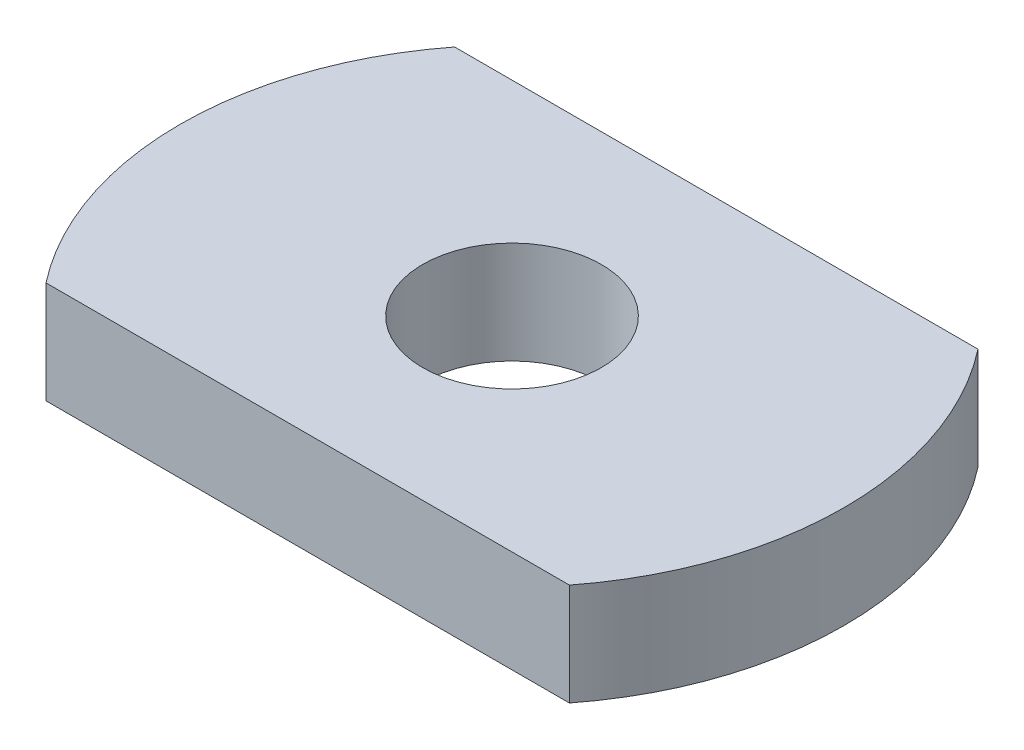
ISO-10303-21;
HEADER;
FILE_DESCRIPTION(('STEP AP214'),'2;1');
FILE_NAME('part.step','',(''),(''),'','','');
FILE_SCHEMA(('AUTOMOTIVE_DESIGN { 1 0 10303 214 1 1 1 1 }'));
ENDSEC;
DATA;
#1=APPLICATION_CONTEXT('core data for automotive mechanical design processes');
#2=APPLICATION_PROTOCOL_DEFINITION('international standard','automotive_design',2000,#1);
#3=PRODUCT_CONTEXT('',#1,'mechanical');
#4=PRODUCT('Part','Part','',(#3));
#5=PRODUCT_RELATED_PRODUCT_CATEGORY('part','',(#4));
#6=PRODUCT_DEFINITION_FORMATION('','',#4);
#7=PRODUCT_DEFINITION_CONTEXT('part definition',#1,'design');
#8=PRODUCT_DEFINITION('design','',#6,#7);
#9=PRODUCT_DEFINITION_SHAPE('','',#8);
#10=(LENGTH_UNIT() NAMED_UNIT(*) SI_UNIT(.MILLI.,.METRE.));
#11=(NAMED_UNIT(*) PLANE_ANGLE_UNIT() SI_UNIT($,.RADIAN.));
#12=(NAMED_UNIT(*) SI_UNIT($,.STERADIAN.) SOLID_ANGLE_UNIT());
#13=UNCERTAINTY_MEASURE_WITH_UNIT(LENGTH_MEASURE(1.E-05),#10,'distance_accuracy_value','');
#14=(GEOMETRIC_REPRESENTATION_CONTEXT(3) GLOBAL_UNCERTAINTY_ASSIGNED_CONTEXT((#13)) GLOBAL_UNIT_ASSIGNED_CONTEXT((#10,
#11,#12)) REPRESENTATION_CONTEXT('',''));
#15=CARTESIAN_POINT('',(0.,0.,0.));
#16=DIRECTION('',(0.,0.,1.));
#17=DIRECTION('',(1.,0.,0.));
#18=AXIS2_PLACEMENT_3D('',#15,#16,#17);
#19=CARTESIAN_POINT('',(0.,2.,4.));
#20=DIRECTION('',(0.,0.,-1.));
#21=DIRECTION('',(-1.,0.,0.));
#22=AXIS2_PLACEMENT_3D('',#19,#20,#21);
#23=PLANE('',#22);
#24=DIRECTION('',(1.,0.,0.));
#25=VECTOR('',#24,1.);
#26=CARTESIAN_POINT('',(0.,0.,4.));
#27=LINE('',#26,#25);
#28=CARTESIAN_POINT('',(-5.1234753829798,0.,4.));
#29=VERTEX_POINT('',#28);
#30=CARTESIAN_POINT('',(5.1234753829798,0.,4.));
#31=VERTEX_POINT('',#30);
#32=EDGE_CURVE('E119',#29,#31,#27,.T.);
#33=ORIENTED_EDGE('',*,*,#32,.T.);
#34=DIRECTION('',(0.,-1.,0.));
#35=VECTOR('',#34,1.);
#36=CARTESIAN_POINT('',(5.1234753829798,2.,4.));
#37=LINE('',#36,#35);
#38=CARTESIAN_POINT('',(5.1234753829798,2.,4.));
#39=VERTEX_POINT('',#38);
#40=EDGE_CURVE('E11',#39,#31,#37,.T.);
#41=ORIENTED_EDGE('',*,*,#40,.F.);
#42=DIRECTION('',(1.,0.,0.));
#43=VECTOR('',#42,1.);
#44=CARTESIAN_POINT('',(0.,2.,4.));
#45=LINE('',#44,#43);
#46=CARTESIAN_POINT('',(-5.1234753829798,2.,4.));
#47=VERTEX_POINT('',#46);
#48=EDGE_CURVE('E96',#47,#39,#45,.T.);
#49=ORIENTED_EDGE('',*,*,#48,.F.);
#50=DIRECTION('',(0.,-1.,0.));
#51=VECTOR('',#50,1.);
#52=CARTESIAN_POINT('',(-5.1234753829798,2.,4.));
#53=LINE('',#52,#51);
#54=EDGE_CURVE('E118',#47,#29,#53,.T.);
#55=ORIENTED_EDGE('',*,*,#54,.T.);
#56=EDGE_LOOP('',(#33,#41,#49,#55));
#57=FACE_BOUND('',#56,.T.);
#58=ADVANCED_FACE('F47',(#57),#23,.F.);
#59=CARTESIAN_POINT('',(0.,2.,0.));
#60=DIRECTION('',(0.,-1.,0.));
#61=DIRECTION('',(0.,0.,-1.));
#62=AXIS2_PLACEMENT_3D('',#59,#60,#61);
#63=CYLINDRICAL_SURFACE('',#62,6.5);
#64=CARTESIAN_POINT('',(0.,0.,0.));
#65=DIRECTION('',(0.,1.,0.));
#66=DIRECTION('',(0.,0.,1.));
#67=AXIS2_PLACEMENT_3D('',#64,#65,#66);
#68=CIRCLE('',#67,6.5);
#69=CARTESIAN_POINT('',(5.1234753829798,0.,-4.));
#70=VERTEX_POINT('',#69);
#71=EDGE_CURVE('E102',#31,#70,#68,.T.);
#72=ORIENTED_EDGE('',*,*,#71,.T.);
#73=DIRECTION('',(0.,-1.,0.));
#74=VECTOR('',#73,1.);
#75=CARTESIAN_POINT('',(5.1234753829798,2.,-4.));
#76=LINE('',#75,#74);
#77=CARTESIAN_POINT('',(5.1234753829798,2.,-4.));
#78=VERTEX_POINT('',#77);
#79=EDGE_CURVE('E56',#78,#70,#76,.T.);
#80=ORIENTED_EDGE('',*,*,#79,.F.);
#81=CARTESIAN_POINT('',(0.,2.,0.));
#82=DIRECTION('',(0.,1.,0.));
#83=DIRECTION('',(0.,0.,1.));
#84=AXIS2_PLACEMENT_3D('',#81,#82,#83);
#85=CIRCLE('',#84,6.5);
#86=EDGE_CURVE('E90',#39,#78,#85,.T.);
#87=ORIENTED_EDGE('',*,*,#86,.F.);
#88=ORIENTED_EDGE('',*,*,#40,.T.);
#89=EDGE_LOOP('',(#72,#80,#87,#88));
#90=FACE_BOUND('',#89,.T.);
#91=ADVANCED_FACE('F101',(#90),#63,.T.);
#92=CARTESIAN_POINT('',(0.,2.,-4.));
#93=DIRECTION('',(0.,0.,-1.));
#94=DIRECTION('',(-1.,0.,0.));
#95=AXIS2_PLACEMENT_3D('',#92,#93,#94);
#96=PLANE('',#95);
#97=DIRECTION('',(1.,0.,0.));
#98=VECTOR('',#97,1.);
#99=CARTESIAN_POINT('',(0.,0.,-4.));
#100=LINE('',#99,#98);
#101=CARTESIAN_POINT('',(-5.1234753829798,0.,-4.));
#102=VERTEX_POINT('',#101);
#103=EDGE_CURVE('E125',#102,#70,#100,.T.);
#104=ORIENTED_EDGE('',*,*,#103,.F.);
#105=DIRECTION('',(0.,-1.,0.));
#106=VECTOR('',#105,1.);
#107=CARTESIAN_POINT('',(-5.1234753829798,2.,-4.));
#108=LINE('',#107,#106);
#109=CARTESIAN_POINT('',(-5.1234753829798,2.,-4.));
#110=VERTEX_POINT('',#109);
#111=EDGE_CURVE('E80',#110,#102,#108,.T.);
#112=ORIENTED_EDGE('',*,*,#111,.F.);
#113=DIRECTION('',(1.,0.,0.));
#114=VECTOR('',#113,1.);
#115=CARTESIAN_POINT('',(0.,2.,-4.));
#116=LINE('',#115,#114);
#117=EDGE_CURVE('E94',#110,#78,#116,.T.);
#118=ORIENTED_EDGE('',*,*,#117,.T.);
#119=ORIENTED_EDGE('',*,*,#79,.T.);
#120=EDGE_LOOP('',(#104,#112,#118,#119));
#121=FACE_BOUND('',#120,.T.);
#122=ADVANCED_FACE('F107',(#121),#96,.T.);
#123=CARTESIAN_POINT('',(0.,2.,0.));
#124=DIRECTION('',(0.,-1.,0.));
#125=DIRECTION('',(0.,0.,-1.));
#126=AXIS2_PLACEMENT_3D('',#123,#124,#125);
#127=CYLINDRICAL_SURFACE('',#126,6.5);
#128=CARTESIAN_POINT('',(0.,0.,0.));
#129=DIRECTION('',(0.,1.,0.));
#130=DIRECTION('',(0.,0.,1.));
#131=AXIS2_PLACEMENT_3D('',#128,#129,#130);
#132=CIRCLE('',#131,6.5);
#133=EDGE_CURVE('E83',#102,#29,#132,.T.);
#134=ORIENTED_EDGE('',*,*,#133,.T.);
#135=ORIENTED_EDGE('',*,*,#54,.F.);
#136=CARTESIAN_POINT('',(0.,2.,0.));
#137=DIRECTION('',(0.,1.,0.));
#138=DIRECTION('',(0.,0.,1.));
#139=AXIS2_PLACEMENT_3D('',#136,#137,#138);
#140=CIRCLE('',#139,6.5);
#141=EDGE_CURVE('E64',#110,#47,#140,.T.);
#142=ORIENTED_EDGE('',*,*,#141,.F.);
#143=ORIENTED_EDGE('',*,*,#111,.T.);
#144=EDGE_LOOP('',(#134,#135,#142,#143));
#145=FACE_BOUND('',#144,.T.);
#146=ADVANCED_FACE('F148',(#145),#127,.T.);
#147=CARTESIAN_POINT('',(0.,2.,0.));
#148=DIRECTION('',(0.,-1.,0.));
#149=DIRECTION('',(0.,0.,-1.));
#150=AXIS2_PLACEMENT_3D('',#147,#148,#149);
#151=CYLINDRICAL_SURFACE('',#150,1.75);
#152=CARTESIAN_POINT('',(0.,2.,0.));
#153=DIRECTION('',(0.,1.,0.));
#154=DIRECTION('',(0.,0.,1.));
#155=AXIS2_PLACEMENT_3D('',#152,#153,#154);
#156=CIRCLE('',#155,1.75);
#157=CARTESIAN_POINT('',(0.,2.,1.75));
#158=VERTEX_POINT('',#157);
#159=EDGE_CURVE('E111',#158,#158,#156,.T.);
#160=ORIENTED_EDGE('',*,*,#159,.T.);
#161=EDGE_LOOP('',(#160));
#162=FACE_BOUND('',#161,.T.);
#163=CARTESIAN_POINT('',(0.,0.,0.));
#164=DIRECTION('',(0.,1.,0.));
#165=DIRECTION('',(0.,0.,1.));
#166=AXIS2_PLACEMENT_3D('',#163,#164,#165);
#167=CIRCLE('',#166,1.75);
#168=CARTESIAN_POINT('',(0.,0.,1.75));
#169=VERTEX_POINT('',#168);
#170=EDGE_CURVE('E130',#169,#169,#167,.T.);
#171=ORIENTED_EDGE('',*,*,#170,.F.);
#172=EDGE_LOOP('',(#171));
#173=FACE_BOUND('',#172,.T.);
#174=ADVANCED_FACE('F146',(#162,#173),#151,.F.);
#175=CARTESIAN_POINT('',(0.,2.,0.));
#176=DIRECTION('',(0.,1.,0.));
#177=DIRECTION('',(0.,0.,1.));
#178=AXIS2_PLACEMENT_3D('',#175,#176,#177);
#179=PLANE('',#178);
#180=ORIENTED_EDGE('',*,*,#48,.T.);
#181=ORIENTED_EDGE('',*,*,#86,.T.);
#182=ORIENTED_EDGE('',*,*,#117,.F.);
#183=ORIENTED_EDGE('',*,*,#141,.T.);
#184=EDGE_LOOP('',(#180,#181,#182,#183));
#185=FACE_BOUND('',#184,.T.);
#186=ORIENTED_EDGE('',*,*,#159,.F.);
#187=EDGE_LOOP('',(#186));
#188=FACE_BOUND('',#187,.T.);
#189=ADVANCED_FACE('F91',(#185,#188),#179,.T.);
#190=CARTESIAN_POINT('',(0.,0.,0.));
#191=DIRECTION('',(0.,1.,0.));
#192=DIRECTION('',(0.,0.,1.));
#193=AXIS2_PLACEMENT_3D('',#190,#191,#192);
#194=PLANE('',#193);
#195=ORIENTED_EDGE('',*,*,#32,.F.);
#196=ORIENTED_EDGE('',*,*,#133,.F.);
#197=ORIENTED_EDGE('',*,*,#103,.T.);
#198=ORIENTED_EDGE('',*,*,#71,.F.);
#199=EDGE_LOOP('',(#195,#196,#197,#198));
#200=FACE_BOUND('',#199,.T.);
#201=ORIENTED_EDGE('',*,*,#170,.T.);
#202=EDGE_LOOP('',(#201));
#203=FACE_BOUND('',#202,.T.);
#204=ADVANCED_FACE('F140',(#200,#203),#194,.F.);
#205=CLOSED_SHELL('',(#58,#91,#122,#146,#174,#189,#204));
#206=MANIFOLD_SOLID_BREP('B2',#205);
#207=ADVANCED_BREP_SHAPE_REPRESENTATION('',(#18,#206),#14);
#208=SHAPE_DEFINITION_REPRESENTATION(#9,#207);
ENDSEC;
END-ISO-10303-21;
